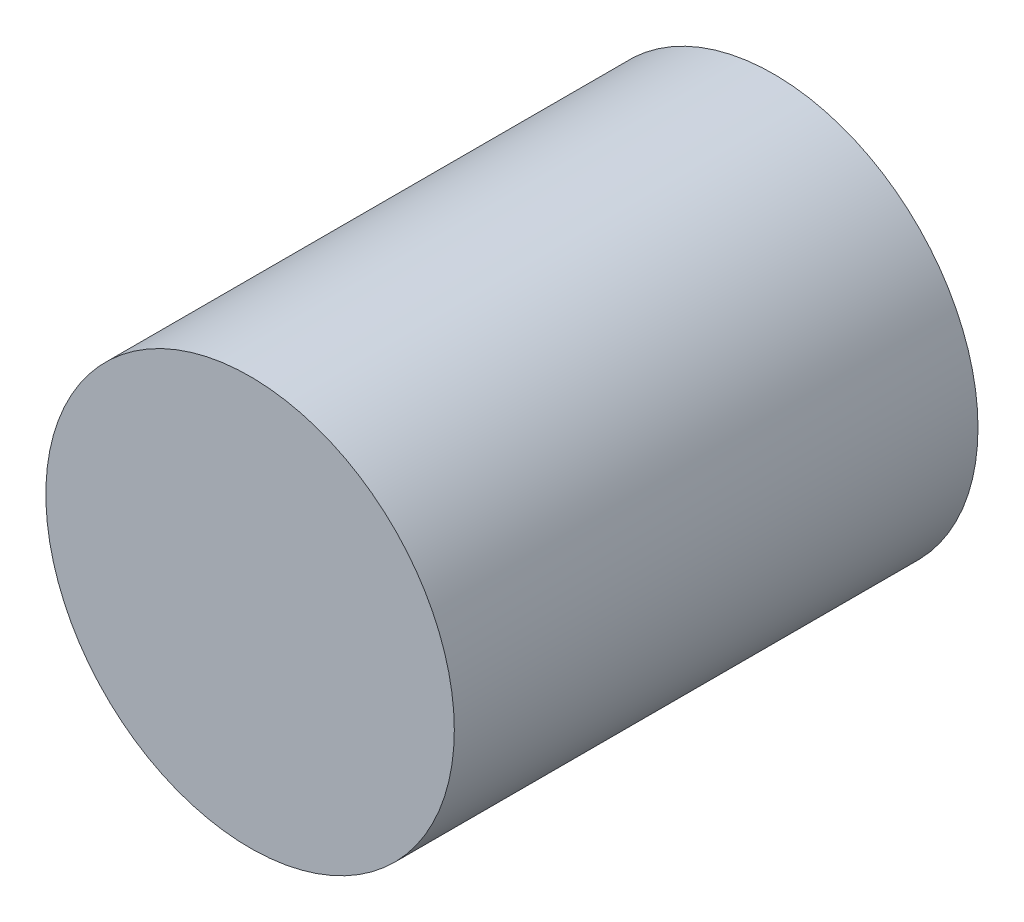
ISO-10303-21;
HEADER;
FILE_DESCRIPTION(('STEP AP214'),'2;1');
FILE_NAME('part.step','',(''),(''),'','','');
FILE_SCHEMA(('AUTOMOTIVE_DESIGN { 1 0 10303 214 1 1 1 1 }'));
ENDSEC;
DATA;
#1=APPLICATION_CONTEXT('core data for automotive mechanical design processes');
#2=APPLICATION_PROTOCOL_DEFINITION('international standard','automotive_design',2000,#1);
#3=PRODUCT_CONTEXT('',#1,'mechanical');
#4=PRODUCT('Part','Part','',(#3));
#5=PRODUCT_RELATED_PRODUCT_CATEGORY('part','',(#4));
#6=PRODUCT_DEFINITION_FORMATION('','',#4);
#7=PRODUCT_DEFINITION_CONTEXT('part definition',#1,'design');
#8=PRODUCT_DEFINITION('design','',#6,#7);
#9=PRODUCT_DEFINITION_SHAPE('','',#8);
#10=(LENGTH_UNIT() NAMED_UNIT(*) SI_UNIT(.MILLI.,.METRE.));
#11=(NAMED_UNIT(*) PLANE_ANGLE_UNIT() SI_UNIT($,.RADIAN.));
#12=(NAMED_UNIT(*) SI_UNIT($,.STERADIAN.) SOLID_ANGLE_UNIT());
#13=UNCERTAINTY_MEASURE_WITH_UNIT(LENGTH_MEASURE(1.E-05),#10,'distance_accuracy_value','');
#14=(GEOMETRIC_REPRESENTATION_CONTEXT(3) GLOBAL_UNCERTAINTY_ASSIGNED_CONTEXT((#13)) GLOBAL_UNIT_ASSIGNED_CONTEXT((#10,
#11,#12)) REPRESENTATION_CONTEXT('',''));
#15=CARTESIAN_POINT('',(0.,0.,0.));
#16=DIRECTION('',(0.,0.,1.));
#17=DIRECTION('',(1.,0.,0.));
#18=AXIS2_PLACEMENT_3D('',#15,#16,#17);
#19=CARTESIAN_POINT('',(0.,0.,25.4));
#20=DIRECTION('',(0.,0.,-1.));
#21=DIRECTION('',(-1.,0.,0.));
#22=AXIS2_PLACEMENT_3D('',#19,#20,#21);
#23=CYLINDRICAL_SURFACE('',#22,9.906);
#24=CARTESIAN_POINT('',(0.,0.,25.4));
#25=DIRECTION('',(0.,0.,1.));
#26=DIRECTION('',(1.,0.,0.));
#27=AXIS2_PLACEMENT_3D('',#24,#25,#26);
#28=CIRCLE('',#27,9.906);
#29=CARTESIAN_POINT('',(9.906,0.,25.4));
#30=VERTEX_POINT('',#29);
#31=EDGE_CURVE('E10',#30,#30,#28,.T.);
#32=ORIENTED_EDGE('',*,*,#31,.F.);
#33=EDGE_LOOP('',(#32));
#34=FACE_BOUND('',#33,.T.);
#35=CARTESIAN_POINT('',(0.,0.,0.));
#36=DIRECTION('',(0.,0.,1.));
#37=DIRECTION('',(1.,0.,0.));
#38=AXIS2_PLACEMENT_3D('',#35,#36,#37);
#39=CIRCLE('',#38,9.906);
#40=CARTESIAN_POINT('',(9.906,0.,0.));
#41=VERTEX_POINT('',#40);
#42=EDGE_CURVE('E34',#41,#41,#39,.T.);
#43=ORIENTED_EDGE('',*,*,#42,.T.);
#44=EDGE_LOOP('',(#43));
#45=FACE_BOUND('',#44,.T.);
#46=ADVANCED_FACE('F31',(#34,#45),#23,.T.);
#47=CARTESIAN_POINT('',(0.,0.,25.4));
#48=DIRECTION('',(0.,0.,1.));
#49=DIRECTION('',(1.,0.,0.));
#50=AXIS2_PLACEMENT_3D('',#47,#48,#49);
#51=PLANE('',#50);
#52=ORIENTED_EDGE('',*,*,#31,.T.);
#53=EDGE_LOOP('',(#52));
#54=FACE_BOUND('',#53,.T.);
#55=ADVANCED_FACE('F46',(#54),#51,.T.);
#56=CARTESIAN_POINT('',(0.,0.,0.));
#57=DIRECTION('',(0.,0.,1.));
#58=DIRECTION('',(1.,0.,0.));
#59=AXIS2_PLACEMENT_3D('',#56,#57,#58);
#60=PLANE('',#59);
#61=ORIENTED_EDGE('',*,*,#42,.F.);
#62=EDGE_LOOP('',(#61));
#63=FACE_BOUND('',#62,.T.);
#64=ADVANCED_FACE('F44',(#63),#60,.F.);
#65=CLOSED_SHELL('',(#46,#55,#64));
#66=MANIFOLD_SOLID_BREP('B2',#65);
#67=ADVANCED_BREP_SHAPE_REPRESENTATION('',(#18,#66),#14);
#68=SHAPE_DEFINITION_REPRESENTATION(#9,#67);
ENDSEC;
END-ISO-10303-21;
